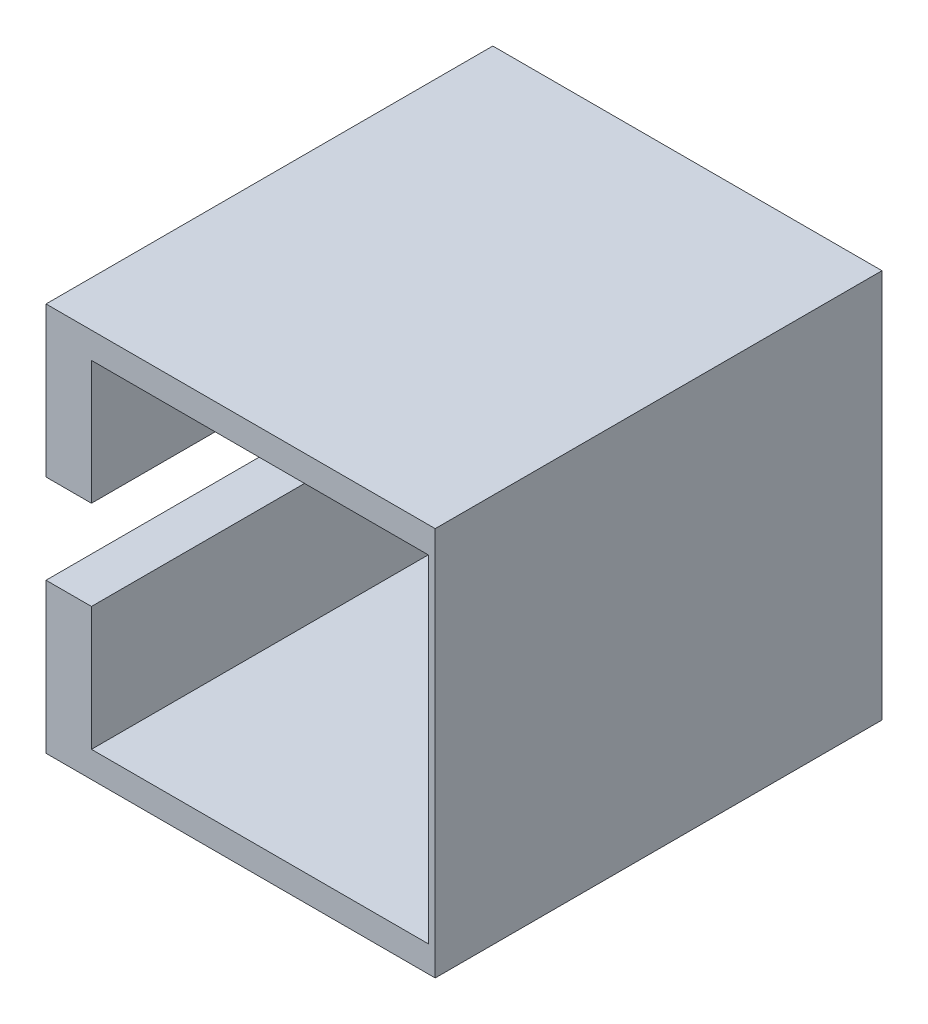
ISO-10303-21;
HEADER;
FILE_DESCRIPTION(('STEP AP214'),'2;1');
FILE_NAME('part.step','',(''),(''),'','','');
FILE_SCHEMA(('AUTOMOTIVE_DESIGN { 1 0 10303 214 1 1 1 1 }'));
ENDSEC;
DATA;
#1=APPLICATION_CONTEXT('core data for automotive mechanical design processes');
#2=APPLICATION_PROTOCOL_DEFINITION('international standard','automotive_design',2000,#1);
#3=PRODUCT_CONTEXT('',#1,'mechanical');
#4=PRODUCT('Part','Part','',(#3));
#5=PRODUCT_RELATED_PRODUCT_CATEGORY('part','',(#4));
#6=PRODUCT_DEFINITION_FORMATION('','',#4);
#7=PRODUCT_DEFINITION_CONTEXT('part definition',#1,'design');
#8=PRODUCT_DEFINITION('design','',#6,#7);
#9=PRODUCT_DEFINITION_SHAPE('','',#8);
#10=(LENGTH_UNIT() NAMED_UNIT(*) SI_UNIT(.MILLI.,.METRE.));
#11=(NAMED_UNIT(*) PLANE_ANGLE_UNIT() SI_UNIT($,.RADIAN.));
#12=(NAMED_UNIT(*) SI_UNIT($,.STERADIAN.) SOLID_ANGLE_UNIT());
#13=UNCERTAINTY_MEASURE_WITH_UNIT(LENGTH_MEASURE(1.E-05),#10,'distance_accuracy_value','');
#14=(GEOMETRIC_REPRESENTATION_CONTEXT(3) GLOBAL_UNCERTAINTY_ASSIGNED_CONTEXT((#13)) GLOBAL_UNIT_ASSIGNED_CONTEXT((#10,
#11,#12)) REPRESENTATION_CONTEXT('',''));
#15=CARTESIAN_POINT('',(0.,0.,0.));
#16=DIRECTION('',(0.,0.,1.));
#17=DIRECTION('',(1.,0.,0.));
#18=AXIS2_PLACEMENT_3D('',#15,#16,#17);
#19=CARTESIAN_POINT('',(0.,0.,12.7));
#20=DIRECTION('',(0.,0.,1.));
#21=DIRECTION('',(1.,0.,0.));
#22=AXIS2_PLACEMENT_3D('',#19,#20,#21);
#23=PLANE('',#22);
#24=DIRECTION('',(-1.,0.,0.));
#25=VECTOR('',#24,1.);
#26=CARTESIAN_POINT('',(-0.640732980688594,-3.52285798068857,12.7));
#27=LINE('',#26,#25);
#28=CARTESIAN_POINT('',(-10.7578579806886,-3.52285798068857,12.7));
#29=VERTEX_POINT('',#28);
#30=CARTESIAN_POINT('',(-13.3407329806886,-3.52285798068857,12.7));
#31=VERTEX_POINT('',#30);
#32=EDGE_CURVE('E124',#29,#31,#27,.T.);
#33=ORIENTED_EDGE('',*,*,#32,.T.);
#34=DIRECTION('',(0.,-1.,0.));
#35=VECTOR('',#34,1.);
#36=CARTESIAN_POINT('',(-13.3407329806886,10.0796420193114,12.7));
#37=LINE('',#36,#35);
#38=CARTESIAN_POINT('',(-13.3407329806886,-12.0453579806886,12.7));
#39=VERTEX_POINT('',#38);
#40=EDGE_CURVE('E134',#31,#39,#37,.T.);
#41=ORIENTED_EDGE('',*,*,#40,.T.);
#42=DIRECTION('',(1.,0.,0.));
#43=VECTOR('',#42,1.);
#44=CARTESIAN_POINT('',(-13.3407329806886,-12.0453579806886,12.7));
#45=LINE('',#44,#43);
#46=CARTESIAN_POINT('',(8.78426701931141,-12.0453579806886,12.7));
#47=VERTEX_POINT('',#46);
#48=EDGE_CURVE('E148',#39,#47,#45,.T.);
#49=ORIENTED_EDGE('',*,*,#48,.T.);
#50=DIRECTION('',(0.,1.,0.));
#51=VECTOR('',#50,1.);
#52=CARTESIAN_POINT('',(8.78426701931141,10.0796420193114,12.7));
#53=LINE('',#52,#51);
#54=CARTESIAN_POINT('',(8.78426701931141,10.0796420193114,12.7));
#55=VERTEX_POINT('',#54);
#56=EDGE_CURVE('E149',#47,#55,#53,.T.);
#57=ORIENTED_EDGE('',*,*,#56,.T.);
#58=DIRECTION('',(-1.,0.,0.));
#59=VECTOR('',#58,1.);
#60=CARTESIAN_POINT('',(-13.3407329806886,10.0796420193114,12.7));
#61=LINE('',#60,#59);
#62=CARTESIAN_POINT('',(-13.3407329806886,10.0796420193114,12.7));
#63=VERTEX_POINT('',#62);
#64=EDGE_CURVE('E145',#55,#63,#61,.T.);
#65=ORIENTED_EDGE('',*,*,#64,.T.);
#66=CARTESIAN_POINT('',(-13.3407329806886,1.55714201931143,12.7));
#67=VERTEX_POINT('',#66);
#68=EDGE_CURVE('E144',#63,#67,#37,.T.);
#69=ORIENTED_EDGE('',*,*,#68,.T.);
#70=DIRECTION('',(-1.,0.,0.));
#71=VECTOR('',#70,1.);
#72=CARTESIAN_POINT('',(-0.640732980688594,1.55714201931143,12.7));
#73=LINE('',#72,#71);
#74=CARTESIAN_POINT('',(-10.7578579806886,1.55714201931143,12.7));
#75=VERTEX_POINT('',#74);
#76=EDGE_CURVE('E137',#75,#67,#73,.T.);
#77=ORIENTED_EDGE('',*,*,#76,.F.);
#78=DIRECTION('',(0.,-1.,0.));
#79=VECTOR('',#78,1.);
#80=CARTESIAN_POINT('',(-10.7578579806886,8.59214201931143,12.7));
#81=LINE('',#80,#79);
#82=CARTESIAN_POINT('',(-10.7578579806886,8.59214201931143,12.7));
#83=VERTEX_POINT('',#82);
#84=EDGE_CURVE('E183',#83,#75,#81,.T.);
#85=ORIENTED_EDGE('',*,*,#84,.F.);
#86=DIRECTION('',(-1.,0.,0.));
#87=VECTOR('',#86,1.);
#88=CARTESIAN_POINT('',(-10.7578579806886,8.59214201931143,12.7));
#89=LINE('',#88,#87);
#90=CARTESIAN_POINT('',(8.39214201931141,8.59214201931143,12.7));
#91=VERTEX_POINT('',#90);
#92=EDGE_CURVE('E195',#91,#83,#89,.T.);
#93=ORIENTED_EDGE('',*,*,#92,.F.);
#94=DIRECTION('',(0.,1.,0.));
#95=VECTOR('',#94,1.);
#96=CARTESIAN_POINT('',(8.39214201931141,8.59214201931143,12.7));
#97=LINE('',#96,#95);
#98=CARTESIAN_POINT('',(8.39214201931141,-10.5578579806886,12.7));
#99=VERTEX_POINT('',#98);
#100=EDGE_CURVE('E193',#99,#91,#97,.T.);
#101=ORIENTED_EDGE('',*,*,#100,.F.);
#102=DIRECTION('',(1.,0.,0.));
#103=VECTOR('',#102,1.);
#104=CARTESIAN_POINT('',(-10.7578579806886,-10.5578579806886,12.7));
#105=LINE('',#104,#103);
#106=CARTESIAN_POINT('',(-10.7578579806886,-10.5578579806886,12.7));
#107=VERTEX_POINT('',#106);
#108=EDGE_CURVE('E199',#107,#99,#105,.T.);
#109=ORIENTED_EDGE('',*,*,#108,.F.);
#110=EDGE_CURVE('E56',#29,#107,#81,.T.);
#111=ORIENTED_EDGE('',*,*,#110,.F.);
#112=EDGE_LOOP('',(#33,#41,#49,#57,#65,#69,#77,#85,#93,#101,#109,#111));
#113=FACE_BOUND('',#112,.T.);
#114=ADVANCED_FACE('F33',(#113),#23,.T.);
#115=CARTESIAN_POINT('',(0.,0.,-12.7));
#116=DIRECTION('',(0.,0.,1.));
#117=DIRECTION('',(1.,0.,0.));
#118=AXIS2_PLACEMENT_3D('',#115,#116,#117);
#119=PLANE('',#118);
#120=DIRECTION('',(0.,1.,0.));
#121=VECTOR('',#120,1.);
#122=CARTESIAN_POINT('',(8.78426701931141,10.0796420193114,-12.7));
#123=LINE('',#122,#121);
#124=CARTESIAN_POINT('',(8.78426701931141,-12.0453579806886,-12.7));
#125=VERTEX_POINT('',#124);
#126=CARTESIAN_POINT('',(8.78426701931141,10.0796420193114,-12.7));
#127=VERTEX_POINT('',#126);
#128=EDGE_CURVE('E155',#125,#127,#123,.T.);
#129=ORIENTED_EDGE('',*,*,#128,.F.);
#130=DIRECTION('',(1.,0.,0.));
#131=VECTOR('',#130,1.);
#132=CARTESIAN_POINT('',(-13.3407329806886,-12.0453579806886,-12.7));
#133=LINE('',#132,#131);
#134=CARTESIAN_POINT('',(-13.3407329806886,-12.0453579806886,-12.7));
#135=VERTEX_POINT('',#134);
#136=EDGE_CURVE('E163',#135,#125,#133,.T.);
#137=ORIENTED_EDGE('',*,*,#136,.F.);
#138=DIRECTION('',(0.,-1.,0.));
#139=VECTOR('',#138,1.);
#140=CARTESIAN_POINT('',(-13.3407329806886,10.0796420193114,-12.7));
#141=LINE('',#140,#139);
#142=CARTESIAN_POINT('',(-13.3407329806886,10.0796420193114,-12.7));
#143=VERTEX_POINT('',#142);
#144=EDGE_CURVE('E161',#143,#135,#141,.T.);
#145=ORIENTED_EDGE('',*,*,#144,.F.);
#146=DIRECTION('',(-1.,0.,0.));
#147=VECTOR('',#146,1.);
#148=CARTESIAN_POINT('',(-13.3407329806886,10.0796420193114,-12.7));
#149=LINE('',#148,#147);
#150=EDGE_CURVE('E158',#127,#143,#149,.T.);
#151=ORIENTED_EDGE('',*,*,#150,.F.);
#152=EDGE_LOOP('',(#129,#137,#145,#151));
#153=FACE_BOUND('',#152,.T.);
#154=DIRECTION('',(0.,1.,0.));
#155=VECTOR('',#154,1.);
#156=CARTESIAN_POINT('',(8.39214201931141,8.59214201931143,-12.7));
#157=LINE('',#156,#155);
#158=CARTESIAN_POINT('',(8.39214201931141,-10.5578579806886,-12.7));
#159=VERTEX_POINT('',#158);
#160=CARTESIAN_POINT('',(8.39214201931141,8.59214201931143,-12.7));
#161=VERTEX_POINT('',#160);
#162=EDGE_CURVE('E202',#159,#161,#157,.T.);
#163=ORIENTED_EDGE('',*,*,#162,.T.);
#164=DIRECTION('',(-1.,0.,0.));
#165=VECTOR('',#164,1.);
#166=CARTESIAN_POINT('',(-10.7578579806886,8.59214201931143,-12.7));
#167=LINE('',#166,#165);
#168=CARTESIAN_POINT('',(-10.7578579806886,8.59214201931143,-12.7));
#169=VERTEX_POINT('',#168);
#170=EDGE_CURVE('E205',#161,#169,#167,.T.);
#171=ORIENTED_EDGE('',*,*,#170,.T.);
#172=DIRECTION('',(0.,-1.,0.));
#173=VECTOR('',#172,1.);
#174=CARTESIAN_POINT('',(-10.7578579806886,8.59214201931143,-12.7));
#175=LINE('',#174,#173);
#176=CARTESIAN_POINT('',(-10.7578579806886,-10.5578579806886,-12.7));
#177=VERTEX_POINT('',#176);
#178=EDGE_CURVE('E208',#169,#177,#175,.T.);
#179=ORIENTED_EDGE('',*,*,#178,.T.);
#180=DIRECTION('',(1.,0.,0.));
#181=VECTOR('',#180,1.);
#182=CARTESIAN_POINT('',(-10.7578579806886,-10.5578579806886,-12.7));
#183=LINE('',#182,#181);
#184=EDGE_CURVE('E196',#177,#159,#183,.T.);
#185=ORIENTED_EDGE('',*,*,#184,.T.);
#186=EDGE_LOOP('',(#163,#171,#179,#185));
#187=FACE_BOUND('',#186,.T.);
#188=ADVANCED_FACE('F234',(#153,#187),#119,.F.);
#189=CARTESIAN_POINT('',(8.78426701931141,10.0796420193114,12.7));
#190=DIRECTION('',(-1.,0.,0.));
#191=DIRECTION('',(0.,0.,1.));
#192=AXIS2_PLACEMENT_3D('',#189,#190,#191);
#193=PLANE('',#192);
#194=ORIENTED_EDGE('',*,*,#128,.T.);
#195=DIRECTION('',(0.,0.,-1.));
#196=VECTOR('',#195,1.);
#197=CARTESIAN_POINT('',(8.78426701931141,10.0796420193114,12.7));
#198=LINE('',#197,#196);
#199=EDGE_CURVE('E171',#55,#127,#198,.T.);
#200=ORIENTED_EDGE('',*,*,#199,.F.);
#201=ORIENTED_EDGE('',*,*,#56,.F.);
#202=DIRECTION('',(0.,0.,-1.));
#203=VECTOR('',#202,1.);
#204=CARTESIAN_POINT('',(8.78426701931141,-12.0453579806886,12.7));
#205=LINE('',#204,#203);
#206=EDGE_CURVE('E154',#47,#125,#205,.T.);
#207=ORIENTED_EDGE('',*,*,#206,.T.);
#208=EDGE_LOOP('',(#194,#200,#201,#207));
#209=FACE_BOUND('',#208,.T.);
#210=ADVANCED_FACE('F35',(#209),#193,.F.);
#211=CARTESIAN_POINT('',(-13.3407329806886,10.0796420193114,12.7));
#212=DIRECTION('',(0.,-1.,0.));
#213=DIRECTION('',(0.,0.,-1.));
#214=AXIS2_PLACEMENT_3D('',#211,#212,#213);
#215=PLANE('',#214);
#216=ORIENTED_EDGE('',*,*,#150,.T.);
#217=DIRECTION('',(0.,0.,-1.));
#218=VECTOR('',#217,1.);
#219=CARTESIAN_POINT('',(-13.3407329806886,10.0796420193114,12.7));
#220=LINE('',#219,#218);
#221=EDGE_CURVE('E168',#63,#143,#220,.T.);
#222=ORIENTED_EDGE('',*,*,#221,.F.);
#223=ORIENTED_EDGE('',*,*,#64,.F.);
#224=ORIENTED_EDGE('',*,*,#199,.T.);
#225=EDGE_LOOP('',(#216,#222,#223,#224));
#226=FACE_BOUND('',#225,.T.);
#227=ADVANCED_FACE('F228',(#226),#215,.F.);
#228=CARTESIAN_POINT('',(-13.3407329806886,10.0796420193114,12.7));
#229=DIRECTION('',(1.,0.,0.));
#230=DIRECTION('',(0.,1.,0.));
#231=AXIS2_PLACEMENT_3D('',#228,#229,#230);
#232=PLANE('',#231);
#233=ORIENTED_EDGE('',*,*,#40,.F.);
#234=DIRECTION('',(0.,0.,1.));
#235=VECTOR('',#234,1.);
#236=CARTESIAN_POINT('',(-13.3407329806886,-3.52285798068857,12.7));
#237=LINE('',#236,#235);
#238=CARTESIAN_POINT('',(-13.3407329806886,-3.52285798068857,-3.175));
#239=VERTEX_POINT('',#238);
#240=EDGE_CURVE('E121',#239,#31,#237,.T.);
#241=ORIENTED_EDGE('',*,*,#240,.F.);
#242=CARTESIAN_POINT('',(-13.3407329806886,-0.982857980688569,-3.175));
#243=DIRECTION('',(-1.,0.,0.));
#244=DIRECTION('',(0.,-1.,0.));
#245=AXIS2_PLACEMENT_3D('',#242,#243,#244);
#246=CIRCLE('',#245,2.54);
#247=CARTESIAN_POINT('',(-13.3407329806886,1.55714201931143,-3.175));
#248=VERTEX_POINT('',#247);
#249=EDGE_CURVE('E138',#248,#239,#246,.T.);
#250=ORIENTED_EDGE('',*,*,#249,.F.);
#251=DIRECTION('',(0.,0.,-1.));
#252=VECTOR('',#251,1.);
#253=CARTESIAN_POINT('',(-13.3407329806886,1.55714201931143,-3.175));
#254=LINE('',#253,#252);
#255=EDGE_CURVE('E131',#67,#248,#254,.T.);
#256=ORIENTED_EDGE('',*,*,#255,.F.);
#257=ORIENTED_EDGE('',*,*,#68,.F.);
#258=ORIENTED_EDGE('',*,*,#221,.T.);
#259=ORIENTED_EDGE('',*,*,#144,.T.);
#260=DIRECTION('',(0.,0.,-1.));
#261=VECTOR('',#260,1.);
#262=CARTESIAN_POINT('',(-13.3407329806886,-12.0453579806886,12.7));
#263=LINE('',#262,#261);
#264=EDGE_CURVE('E142',#39,#135,#263,.T.);
#265=ORIENTED_EDGE('',*,*,#264,.F.);
#266=EDGE_LOOP('',(#233,#241,#250,#256,#257,#258,#259,#265));
#267=FACE_BOUND('',#266,.T.);
#268=ADVANCED_FACE('F140',(#267),#232,.F.);
#269=CARTESIAN_POINT('',(-13.3407329806886,-12.0453579806886,12.7));
#270=DIRECTION('',(0.,1.,0.));
#271=DIRECTION('',(0.,0.,1.));
#272=AXIS2_PLACEMENT_3D('',#269,#270,#271);
#273=PLANE('',#272);
#274=ORIENTED_EDGE('',*,*,#136,.T.);
#275=ORIENTED_EDGE('',*,*,#206,.F.);
#276=ORIENTED_EDGE('',*,*,#48,.F.);
#277=ORIENTED_EDGE('',*,*,#264,.T.);
#278=EDGE_LOOP('',(#274,#275,#276,#277));
#279=FACE_BOUND('',#278,.T.);
#280=ADVANCED_FACE('F237',(#279),#273,.F.);
#281=CARTESIAN_POINT('',(8.39214201931141,8.59214201931143,12.7));
#282=DIRECTION('',(-1.,0.,0.));
#283=DIRECTION('',(0.,0.,1.));
#284=AXIS2_PLACEMENT_3D('',#281,#282,#283);
#285=PLANE('',#284);
#286=ORIENTED_EDGE('',*,*,#162,.F.);
#287=DIRECTION('',(0.,0.,-1.));
#288=VECTOR('',#287,1.);
#289=CARTESIAN_POINT('',(8.39214201931141,-10.5578579806886,12.7));
#290=LINE('',#289,#288);
#291=EDGE_CURVE('E201',#99,#159,#290,.T.);
#292=ORIENTED_EDGE('',*,*,#291,.F.);
#293=ORIENTED_EDGE('',*,*,#100,.T.);
#294=DIRECTION('',(0.,0.,-1.));
#295=VECTOR('',#294,1.);
#296=CARTESIAN_POINT('',(8.39214201931141,8.59214201931143,12.7));
#297=LINE('',#296,#295);
#298=EDGE_CURVE('E159',#91,#161,#297,.T.);
#299=ORIENTED_EDGE('',*,*,#298,.T.);
#300=EDGE_LOOP('',(#286,#292,#293,#299));
#301=FACE_BOUND('',#300,.T.);
#302=ADVANCED_FACE('F239',(#301),#285,.T.);
#303=CARTESIAN_POINT('',(-10.7578579806886,8.59214201931143,12.7));
#304=DIRECTION('',(0.,-1.,0.));
#305=DIRECTION('',(0.,0.,-1.));
#306=AXIS2_PLACEMENT_3D('',#303,#304,#305);
#307=PLANE('',#306);
#308=ORIENTED_EDGE('',*,*,#170,.F.);
#309=ORIENTED_EDGE('',*,*,#298,.F.);
#310=ORIENTED_EDGE('',*,*,#92,.T.);
#311=DIRECTION('',(0.,0.,-1.));
#312=VECTOR('',#311,1.);
#313=CARTESIAN_POINT('',(-10.7578579806886,8.59214201931143,12.7));
#314=LINE('',#313,#312);
#315=EDGE_CURVE('E217',#83,#169,#314,.T.);
#316=ORIENTED_EDGE('',*,*,#315,.T.);
#317=EDGE_LOOP('',(#308,#309,#310,#316));
#318=FACE_BOUND('',#317,.T.);
#319=ADVANCED_FACE('F245',(#318),#307,.T.);
#320=CARTESIAN_POINT('',(-10.7578579806886,8.59214201931143,12.7));
#321=DIRECTION('',(1.,0.,0.));
#322=DIRECTION('',(0.,0.,-1.));
#323=AXIS2_PLACEMENT_3D('',#320,#321,#322);
#324=PLANE('',#323);
#325=DIRECTION('',(0.,0.,-1.));
#326=VECTOR('',#325,1.);
#327=CARTESIAN_POINT('',(-10.7578579806886,-3.52285798068857,12.7));
#328=LINE('',#327,#326);
#329=CARTESIAN_POINT('',(-10.7578579806886,-3.52285798068857,-3.175));
#330=VERTEX_POINT('',#329);
#331=EDGE_CURVE('E11',#29,#330,#328,.T.);
#332=ORIENTED_EDGE('',*,*,#331,.F.);
#333=ORIENTED_EDGE('',*,*,#110,.T.);
#334=DIRECTION('',(0.,0.,-1.));
#335=VECTOR('',#334,1.);
#336=CARTESIAN_POINT('',(-10.7578579806886,-10.5578579806886,12.7));
#337=LINE('',#336,#335);
#338=EDGE_CURVE('E215',#107,#177,#337,.T.);
#339=ORIENTED_EDGE('',*,*,#338,.T.);
#340=ORIENTED_EDGE('',*,*,#178,.F.);
#341=ORIENTED_EDGE('',*,*,#315,.F.);
#342=ORIENTED_EDGE('',*,*,#84,.T.);
#343=DIRECTION('',(0.,0.,1.));
#344=VECTOR('',#343,1.);
#345=CARTESIAN_POINT('',(-10.7578579806886,1.55714201931143,12.7));
#346=LINE('',#345,#344);
#347=CARTESIAN_POINT('',(-10.7578579806886,1.55714201931143,-3.175));
#348=VERTEX_POINT('',#347);
#349=EDGE_CURVE('E174',#348,#75,#346,.T.);
#350=ORIENTED_EDGE('',*,*,#349,.F.);
#351=CARTESIAN_POINT('',(-10.7578579806886,-0.982857980688569,-3.175));
#352=DIRECTION('',(1.,0.,0.));
#353=DIRECTION('',(0.,0.,-1.));
#354=AXIS2_PLACEMENT_3D('',#351,#352,#353);
#355=CIRCLE('',#354,2.54);
#356=EDGE_CURVE('E41',#330,#348,#355,.T.);
#357=ORIENTED_EDGE('',*,*,#356,.F.);
#358=EDGE_LOOP('',(#332,#333,#339,#340,#341,#342,#350,#357));
#359=FACE_BOUND('',#358,.T.);
#360=ADVANCED_FACE('F180',(#359),#324,.T.);
#361=CARTESIAN_POINT('',(-10.7578579806886,-10.5578579806886,12.7));
#362=DIRECTION('',(0.,1.,0.));
#363=DIRECTION('',(0.,0.,1.));
#364=AXIS2_PLACEMENT_3D('',#361,#362,#363);
#365=PLANE('',#364);
#366=ORIENTED_EDGE('',*,*,#184,.F.);
#367=ORIENTED_EDGE('',*,*,#338,.F.);
#368=ORIENTED_EDGE('',*,*,#108,.T.);
#369=ORIENTED_EDGE('',*,*,#291,.T.);
#370=EDGE_LOOP('',(#366,#367,#368,#369));
#371=FACE_BOUND('',#370,.T.);
#372=ADVANCED_FACE('F261',(#371),#365,.T.);
#373=CARTESIAN_POINT('',(-0.640732980688594,-3.52285798068857,12.7));
#374=DIRECTION('',(0.,-1.,0.));
#375=DIRECTION('',(1.,0.,0.));
#376=AXIS2_PLACEMENT_3D('',#373,#374,#375);
#377=PLANE('',#376);
#378=ORIENTED_EDGE('',*,*,#331,.T.);
#379=DIRECTION('',(-1.,0.,0.));
#380=VECTOR('',#379,1.);
#381=CARTESIAN_POINT('',(-0.640732980688594,-3.52285798068857,-3.175));
#382=LINE('',#381,#380);
#383=EDGE_CURVE('E126',#330,#239,#382,.T.);
#384=ORIENTED_EDGE('',*,*,#383,.T.);
#385=ORIENTED_EDGE('',*,*,#240,.T.);
#386=ORIENTED_EDGE('',*,*,#32,.F.);
#387=EDGE_LOOP('',(#378,#384,#385,#386));
#388=FACE_BOUND('',#387,.T.);
#389=ADVANCED_FACE('F123',(#388),#377,.F.);
#390=CARTESIAN_POINT('',(-0.640732980688594,-0.982857980688567,-3.175));
#391=DIRECTION('',(-1.,0.,0.));
#392=DIRECTION('',(0.,-1.,0.));
#393=AXIS2_PLACEMENT_3D('',#390,#391,#392);
#394=CYLINDRICAL_SURFACE('',#393,2.54);
#395=ORIENTED_EDGE('',*,*,#356,.T.);
#396=DIRECTION('',(-1.,0.,0.));
#397=VECTOR('',#396,1.);
#398=CARTESIAN_POINT('',(-0.640732980688594,1.55714201931143,-3.175));
#399=LINE('',#398,#397);
#400=EDGE_CURVE('E48',#348,#248,#399,.T.);
#401=ORIENTED_EDGE('',*,*,#400,.T.);
#402=ORIENTED_EDGE('',*,*,#249,.T.);
#403=ORIENTED_EDGE('',*,*,#383,.F.);
#404=EDGE_LOOP('',(#395,#401,#402,#403));
#405=FACE_BOUND('',#404,.T.);
#406=ADVANCED_FACE('F178',(#405),#394,.F.);
#407=CARTESIAN_POINT('',(-0.640732980688594,1.55714201931143,-3.175));
#408=DIRECTION('',(0.,1.,0.));
#409=DIRECTION('',(-1.,0.,0.));
#410=AXIS2_PLACEMENT_3D('',#407,#408,#409);
#411=PLANE('',#410);
#412=ORIENTED_EDGE('',*,*,#349,.T.);
#413=ORIENTED_EDGE('',*,*,#76,.T.);
#414=ORIENTED_EDGE('',*,*,#255,.T.);
#415=ORIENTED_EDGE('',*,*,#400,.F.);
#416=EDGE_LOOP('',(#412,#413,#414,#415));
#417=FACE_BOUND('',#416,.T.);
#418=ADVANCED_FACE('F185',(#417),#411,.F.);
#419=CLOSED_SHELL('',(#114,#188,#210,#227,#268,#280,#302,#319,#360,#372,#389,#406,#418));
#420=MANIFOLD_SOLID_BREP('B2',#419);
#421=ADVANCED_BREP_SHAPE_REPRESENTATION('',(#18,#420),#14);
#422=SHAPE_DEFINITION_REPRESENTATION(#9,#421);
ENDSEC;
END-ISO-10303-21;
